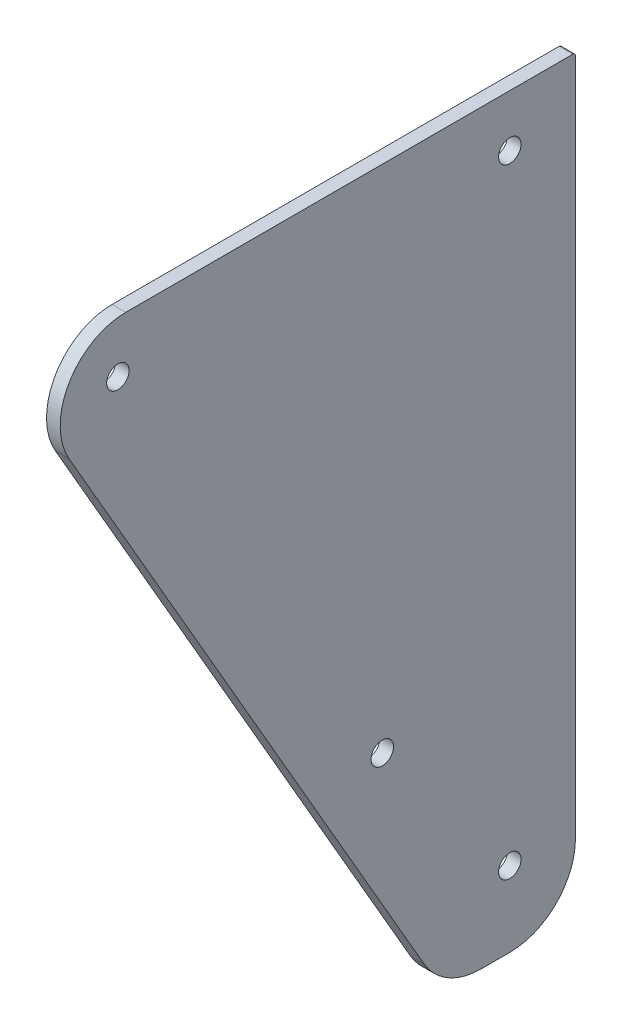
ISO-10303-21;
HEADER;
FILE_DESCRIPTION(('STEP AP214'),'2;1');
FILE_NAME('part.step','',(''),(''),'','','');
FILE_SCHEMA(('AUTOMOTIVE_DESIGN { 1 0 10303 214 1 1 1 1 }'));
ENDSEC;
DATA;
#1=APPLICATION_CONTEXT('core data for automotive mechanical design processes');
#2=APPLICATION_PROTOCOL_DEFINITION('international standard','automotive_design',2000,#1);
#3=PRODUCT_CONTEXT('',#1,'mechanical');
#4=PRODUCT('Part','Part','',(#3));
#5=PRODUCT_RELATED_PRODUCT_CATEGORY('part','',(#4));
#6=PRODUCT_DEFINITION_FORMATION('','',#4);
#7=PRODUCT_DEFINITION_CONTEXT('part definition',#1,'design');
#8=PRODUCT_DEFINITION('design','',#6,#7);
#9=PRODUCT_DEFINITION_SHAPE('','',#8);
#10=(LENGTH_UNIT() NAMED_UNIT(*) SI_UNIT(.MILLI.,.METRE.));
#11=(NAMED_UNIT(*) PLANE_ANGLE_UNIT() SI_UNIT($,.RADIAN.));
#12=(NAMED_UNIT(*) SI_UNIT($,.STERADIAN.) SOLID_ANGLE_UNIT());
#13=UNCERTAINTY_MEASURE_WITH_UNIT(LENGTH_MEASURE(1.E-05),#10,'distance_accuracy_value','');
#14=(GEOMETRIC_REPRESENTATION_CONTEXT(3) GLOBAL_UNCERTAINTY_ASSIGNED_CONTEXT((#13)) GLOBAL_UNIT_ASSIGNED_CONTEXT((#10,
#11,#12)) REPRESENTATION_CONTEXT('',''));
#15=CARTESIAN_POINT('',(0.,0.,0.));
#16=DIRECTION('',(0.,0.,1.));
#17=DIRECTION('',(1.,0.,0.));
#18=AXIS2_PLACEMENT_3D('',#15,#16,#17);
#19=CARTESIAN_POINT('',(5.,25.,10.5662432702593));
#20=DIRECTION('',(-1.,0.,0.));
#21=DIRECTION('',(0.,0.,1.));
#22=AXIS2_PLACEMENT_3D('',#19,#20,#21);
#23=CYLINDRICAL_SURFACE('',#22,24.);
#24=CARTESIAN_POINT('',(0.,25.,10.5662432702593));
#25=DIRECTION('',(-1.,0.,0.));
#26=DIRECTION('',(0.,0.,1.));
#27=AXIS2_PLACEMENT_3D('',#24,#25,#26);
#28=CIRCLE('',#27,24.);
#29=CARTESIAN_POINT('',(0.,1.,10.5662432702593));
#30=VERTEX_POINT('',#29);
#31=CARTESIAN_POINT('',(0.,13.0000000000001,31.3508529610859));
#32=VERTEX_POINT('',#31);
#33=EDGE_CURVE('E145',#30,#32,#28,.T.);
#34=ORIENTED_EDGE('',*,*,#33,.F.);
#35=DIRECTION('',(-1.,0.,0.));
#36=VECTOR('',#35,1.);
#37=CARTESIAN_POINT('',(5.,1.,10.5662432702593));
#38=LINE('',#37,#36);
#39=CARTESIAN_POINT('',(5.,1.,10.5662432702593));
#40=VERTEX_POINT('',#39);
#41=EDGE_CURVE('E11',#40,#30,#38,.T.);
#42=ORIENTED_EDGE('',*,*,#41,.F.);
#43=CARTESIAN_POINT('',(5.,25.,10.5662432702593));
#44=DIRECTION('',(-1.,0.,0.));
#45=DIRECTION('',(0.,0.,1.));
#46=AXIS2_PLACEMENT_3D('',#43,#44,#45);
#47=CIRCLE('',#46,24.);
#48=CARTESIAN_POINT('',(5.,13.0000000000001,31.3508529610859));
#49=VERTEX_POINT('',#48);
#50=EDGE_CURVE('E174',#40,#49,#47,.T.);
#51=ORIENTED_EDGE('',*,*,#50,.T.);
#52=DIRECTION('',(-1.,0.,0.));
#53=VECTOR('',#52,1.);
#54=CARTESIAN_POINT('',(5.,13.0000000000001,31.3508529610859));
#55=LINE('',#54,#53);
#56=EDGE_CURVE('E45',#49,#32,#55,.T.);
#57=ORIENTED_EDGE('',*,*,#56,.T.);
#58=EDGE_LOOP('',(#34,#42,#51,#57));
#59=FACE_BOUND('',#58,.T.);
#60=ADVANCED_FACE('F42',(#59),#23,.T.);
#61=CARTESIAN_POINT('',(5.,1.,0.));
#62=DIRECTION('',(0.,-1.,0.));
#63=DIRECTION('',(0.,0.,-1.));
#64=AXIS2_PLACEMENT_3D('',#61,#62,#63);
#65=PLANE('',#64);
#66=DIRECTION('',(0.,0.,1.));
#67=VECTOR('',#66,1.);
#68=CARTESIAN_POINT('',(0.,1.,0.));
#69=LINE('',#68,#67);
#70=CARTESIAN_POINT('',(0.,0.999999999999997,0.));
#71=VERTEX_POINT('',#70);
#72=EDGE_CURVE('E171',#71,#30,#69,.T.);
#73=ORIENTED_EDGE('',*,*,#72,.F.);
#74=DIRECTION('',(-1.,0.,0.));
#75=VECTOR('',#74,1.);
#76=CARTESIAN_POINT('',(5.,0.999999999999997,0.));
#77=LINE('',#76,#75);
#78=CARTESIAN_POINT('',(5.,0.999999999999997,0.));
#79=VERTEX_POINT('',#78);
#80=EDGE_CURVE('E52',#79,#71,#77,.T.);
#81=ORIENTED_EDGE('',*,*,#80,.F.);
#82=DIRECTION('',(0.,0.,1.));
#83=VECTOR('',#82,1.);
#84=CARTESIAN_POINT('',(5.,1.,0.));
#85=LINE('',#84,#83);
#86=EDGE_CURVE('E131',#79,#40,#85,.T.);
#87=ORIENTED_EDGE('',*,*,#86,.T.);
#88=ORIENTED_EDGE('',*,*,#41,.T.);
#89=EDGE_LOOP('',(#73,#81,#87,#88));
#90=FACE_BOUND('',#89,.T.);
#91=ADVANCED_FACE('F192',(#90),#65,.T.);
#92=CARTESIAN_POINT('',(5.,25.,0.));
#93=DIRECTION('',(-1.,0.,0.));
#94=DIRECTION('',(0.,0.,1.));
#95=AXIS2_PLACEMENT_3D('',#92,#93,#94);
#96=CYLINDRICAL_SURFACE('',#95,24.);
#97=CARTESIAN_POINT('',(0.,25.,0.));
#98=DIRECTION('',(-1.,0.,0.));
#99=DIRECTION('',(0.,0.,1.));
#100=AXIS2_PLACEMENT_3D('',#97,#98,#99);
#101=CIRCLE('',#100,24.);
#102=CARTESIAN_POINT('',(0.,25.,-24.));
#103=VERTEX_POINT('',#102);
#104=EDGE_CURVE('E117',#103,#71,#101,.T.);
#105=ORIENTED_EDGE('',*,*,#104,.F.);
#106=DIRECTION('',(-1.,0.,0.));
#107=VECTOR('',#106,1.);
#108=CARTESIAN_POINT('',(5.,25.,-24.));
#109=LINE('',#108,#107);
#110=CARTESIAN_POINT('',(5.,25.,-24.));
#111=VERTEX_POINT('',#110);
#112=EDGE_CURVE('E112',#111,#103,#109,.T.);
#113=ORIENTED_EDGE('',*,*,#112,.F.);
#114=CARTESIAN_POINT('',(5.,25.,0.));
#115=DIRECTION('',(-1.,0.,0.));
#116=DIRECTION('',(0.,0.,1.));
#117=AXIS2_PLACEMENT_3D('',#114,#115,#116);
#118=CIRCLE('',#117,24.);
#119=EDGE_CURVE('E115',#111,#79,#118,.T.);
#120=ORIENTED_EDGE('',*,*,#119,.T.);
#121=ORIENTED_EDGE('',*,*,#80,.T.);
#122=EDGE_LOOP('',(#105,#113,#120,#121));
#123=FACE_BOUND('',#122,.T.);
#124=ADVANCED_FACE('F114',(#123),#96,.T.);
#125=CARTESIAN_POINT('',(5.,273.,-24.));
#126=DIRECTION('',(0.,0.,-1.));
#127=DIRECTION('',(-1.,0.,0.));
#128=AXIS2_PLACEMENT_3D('',#125,#126,#127);
#129=PLANE('',#128);
#130=DIRECTION('',(0.,-1.,0.));
#131=VECTOR('',#130,1.);
#132=CARTESIAN_POINT('',(0.,273.,-24.));
#133=LINE('',#132,#131);
#134=CARTESIAN_POINT('',(0.,273.,-24.));
#135=VERTEX_POINT('',#134);
#136=EDGE_CURVE('E166',#135,#103,#133,.T.);
#137=ORIENTED_EDGE('',*,*,#136,.F.);
#138=DIRECTION('',(-1.,0.,0.));
#139=VECTOR('',#138,1.);
#140=CARTESIAN_POINT('',(5.,273.,-24.));
#141=LINE('',#140,#139);
#142=CARTESIAN_POINT('',(5.,273.,-24.));
#143=VERTEX_POINT('',#142);
#144=EDGE_CURVE('E123',#143,#135,#141,.T.);
#145=ORIENTED_EDGE('',*,*,#144,.F.);
#146=DIRECTION('',(0.,-1.,0.));
#147=VECTOR('',#146,1.);
#148=CARTESIAN_POINT('',(5.,273.,-24.));
#149=LINE('',#148,#147);
#150=EDGE_CURVE('E129',#143,#111,#149,.T.);
#151=ORIENTED_EDGE('',*,*,#150,.T.);
#152=ORIENTED_EDGE('',*,*,#112,.T.);
#153=EDGE_LOOP('',(#137,#145,#151,#152));
#154=FACE_BOUND('',#153,.T.);
#155=ADVANCED_FACE('F134',(#154),#129,.T.);
#156=CARTESIAN_POINT('',(5.,273.,-23.));
#157=DIRECTION('',(-1.,0.,0.));
#158=DIRECTION('',(0.,0.,1.));
#159=AXIS2_PLACEMENT_3D('',#156,#157,#158);
#160=CYLINDRICAL_SURFACE('',#159,1.);
#161=CARTESIAN_POINT('',(0.,273.,-23.));
#162=DIRECTION('',(-1.,0.,0.));
#163=DIRECTION('',(0.,0.,1.));
#164=AXIS2_PLACEMENT_3D('',#161,#162,#163);
#165=CIRCLE('',#164,1.);
#166=CARTESIAN_POINT('',(0.,274.,-23.));
#167=VERTEX_POINT('',#166);
#168=EDGE_CURVE('E162',#167,#135,#165,.T.);
#169=ORIENTED_EDGE('',*,*,#168,.F.);
#170=DIRECTION('',(-1.,0.,0.));
#171=VECTOR('',#170,1.);
#172=CARTESIAN_POINT('',(5.,274.,-23.));
#173=LINE('',#172,#171);
#174=CARTESIAN_POINT('',(5.,274.,-23.));
#175=VERTEX_POINT('',#174);
#176=EDGE_CURVE('E180',#175,#167,#173,.T.);
#177=ORIENTED_EDGE('',*,*,#176,.F.);
#178=CARTESIAN_POINT('',(5.,273.,-23.));
#179=DIRECTION('',(-1.,0.,0.));
#180=DIRECTION('',(0.,0.,1.));
#181=AXIS2_PLACEMENT_3D('',#178,#179,#180);
#182=CIRCLE('',#181,1.);
#183=EDGE_CURVE('E136',#175,#143,#182,.T.);
#184=ORIENTED_EDGE('',*,*,#183,.T.);
#185=ORIENTED_EDGE('',*,*,#144,.T.);
#186=EDGE_LOOP('',(#169,#177,#184,#185));
#187=FACE_BOUND('',#186,.T.);
#188=ADVANCED_FACE('F205',(#187),#160,.T.);
#189=CARTESIAN_POINT('',(5.,274.,140.470053837923));
#190=DIRECTION('',(0.,1.,0.));
#191=DIRECTION('',(0.,0.,1.));
#192=AXIS2_PLACEMENT_3D('',#189,#190,#191);
#193=PLANE('',#192);
#194=DIRECTION('',(0.,0.,-1.));
#195=VECTOR('',#194,1.);
#196=CARTESIAN_POINT('',(0.,274.,140.470053837923));
#197=LINE('',#196,#195);
#198=CARTESIAN_POINT('',(0.,274.,140.470053837923));
#199=VERTEX_POINT('',#198);
#200=EDGE_CURVE('E158',#199,#167,#197,.T.);
#201=ORIENTED_EDGE('',*,*,#200,.F.);
#202=DIRECTION('',(-1.,0.,0.));
#203=VECTOR('',#202,1.);
#204=CARTESIAN_POINT('',(5.,274.,140.470053837923));
#205=LINE('',#204,#203);
#206=CARTESIAN_POINT('',(5.,274.,140.470053837923));
#207=VERTEX_POINT('',#206);
#208=EDGE_CURVE('E183',#207,#199,#205,.T.);
#209=ORIENTED_EDGE('',*,*,#208,.F.);
#210=DIRECTION('',(0.,0.,-1.));
#211=VECTOR('',#210,1.);
#212=CARTESIAN_POINT('',(5.,274.,140.470053837923));
#213=LINE('',#212,#211);
#214=EDGE_CURVE('E139',#207,#175,#213,.T.);
#215=ORIENTED_EDGE('',*,*,#214,.T.);
#216=ORIENTED_EDGE('',*,*,#176,.T.);
#217=EDGE_LOOP('',(#201,#209,#215,#216));
#218=FACE_BOUND('',#217,.T.);
#219=ADVANCED_FACE('F208',(#218),#193,.T.);
#220=CARTESIAN_POINT('',(5.,250.,140.470053837923));
#221=DIRECTION('',(-1.,0.,0.));
#222=DIRECTION('',(0.,0.,1.));
#223=AXIS2_PLACEMENT_3D('',#220,#221,#222);
#224=CYLINDRICAL_SURFACE('',#223,24.);
#225=CARTESIAN_POINT('',(0.,250.,140.470053837923));
#226=DIRECTION('',(-1.,0.,0.));
#227=DIRECTION('',(0.,0.,1.));
#228=AXIS2_PLACEMENT_3D('',#225,#226,#227);
#229=CIRCLE('',#228,24.);
#230=CARTESIAN_POINT('',(0.,238.,161.25466352875));
#231=VERTEX_POINT('',#230);
#232=EDGE_CURVE('E154',#231,#199,#229,.T.);
#233=ORIENTED_EDGE('',*,*,#232,.F.);
#234=DIRECTION('',(-1.,0.,0.));
#235=VECTOR('',#234,1.);
#236=CARTESIAN_POINT('',(5.,238.,161.25466352875));
#237=LINE('',#236,#235);
#238=CARTESIAN_POINT('',(5.,238.,161.25466352875));
#239=VERTEX_POINT('',#238);
#240=EDGE_CURVE('E185',#239,#231,#237,.T.);
#241=ORIENTED_EDGE('',*,*,#240,.F.);
#242=CARTESIAN_POINT('',(5.,250.,140.470053837923));
#243=DIRECTION('',(-1.,0.,0.));
#244=DIRECTION('',(0.,0.,1.));
#245=AXIS2_PLACEMENT_3D('',#242,#243,#244);
#246=CIRCLE('',#245,24.);
#247=EDGE_CURVE('E284',#239,#207,#246,.T.);
#248=ORIENTED_EDGE('',*,*,#247,.T.);
#249=ORIENTED_EDGE('',*,*,#208,.T.);
#250=EDGE_LOOP('',(#233,#241,#248,#249));
#251=FACE_BOUND('',#250,.T.);
#252=ADVANCED_FACE('F212',(#251),#224,.T.);
#253=CARTESIAN_POINT('',(5.,13.0000000000001,31.3508529610859));
#254=DIRECTION('',(0.,-0.499999999999995,0.866025403784442));
#255=DIRECTION('',(0.,-0.866025403784442,-0.499999999999995));
#256=AXIS2_PLACEMENT_3D('',#253,#254,#255);
#257=PLANE('',#256);
#258=DIRECTION('',(0.,0.866025403784442,0.499999999999995));
#259=VECTOR('',#258,1.);
#260=CARTESIAN_POINT('',(0.,13.0000000000001,31.3508529610859));
#261=LINE('',#260,#259);
#262=EDGE_CURVE('E149',#32,#231,#261,.T.);
#263=ORIENTED_EDGE('',*,*,#262,.F.);
#264=ORIENTED_EDGE('',*,*,#56,.F.);
#265=DIRECTION('',(0.,0.866025403784442,0.499999999999995));
#266=VECTOR('',#265,1.);
#267=CARTESIAN_POINT('',(5.,13.0000000000001,31.3508529610859));
#268=LINE('',#267,#266);
#269=EDGE_CURVE('E281',#49,#239,#268,.T.);
#270=ORIENTED_EDGE('',*,*,#269,.T.);
#271=ORIENTED_EDGE('',*,*,#240,.T.);
#272=EDGE_LOOP('',(#263,#264,#270,#271));
#273=FACE_BOUND('',#272,.T.);
#274=ADVANCED_FACE('F189',(#273),#257,.T.);
#275=CARTESIAN_POINT('',(5.,25.,10.5662432702593));
#276=DIRECTION('',(-1.,0.,0.));
#277=DIRECTION('',(0.,0.,1.));
#278=AXIS2_PLACEMENT_3D('',#275,#276,#277);
#279=PLANE('',#278);
#280=CARTESIAN_POINT('',(5.,87.5000000000012,46.650635094611));
#281=DIRECTION('',(-1.,0.,0.));
#282=DIRECTION('',(0.,0.,-1.));
#283=AXIS2_PLACEMENT_3D('',#280,#281,#282);
#284=CIRCLE('',#283,4.1);
#285=CARTESIAN_POINT('',(5.,87.5000000000012,42.550635094611));
#286=VERTEX_POINT('',#285);
#287=EDGE_CURVE('E247',#286,#286,#284,.T.);
#288=ORIENTED_EDGE('',*,*,#287,.T.);
#289=EDGE_LOOP('',(#288));
#290=FACE_BOUND('',#289,.T.);
#291=CARTESIAN_POINT('',(5.,28.5,0.));
#292=DIRECTION('',(-1.,0.,0.));
#293=DIRECTION('',(0.,0.,-1.));
#294=AXIS2_PLACEMENT_3D('',#291,#292,#293);
#295=CIRCLE('',#294,4.1);
#296=CARTESIAN_POINT('',(5.,28.5,-4.1));
#297=VERTEX_POINT('',#296);
#298=EDGE_CURVE('E257',#297,#297,#295,.T.);
#299=ORIENTED_EDGE('',*,*,#298,.T.);
#300=EDGE_LOOP('',(#299));
#301=FACE_BOUND('',#300,.T.);
#302=CARTESIAN_POINT('',(5.,255.,0.));
#303=DIRECTION('',(-1.,0.,0.));
#304=DIRECTION('',(0.,0.,-1.));
#305=AXIS2_PLACEMENT_3D('',#302,#303,#304);
#306=CIRCLE('',#305,4.1);
#307=CARTESIAN_POINT('',(5.,255.,-4.1));
#308=VERTEX_POINT('',#307);
#309=EDGE_CURVE('E265',#308,#308,#306,.T.);
#310=ORIENTED_EDGE('',*,*,#309,.T.);
#311=EDGE_LOOP('',(#310));
#312=FACE_BOUND('',#311,.T.);
#313=CARTESIAN_POINT('',(5.,255.,143.356805183871));
#314=DIRECTION('',(-1.,0.,0.));
#315=DIRECTION('',(0.,0.,-1.));
#316=AXIS2_PLACEMENT_3D('',#313,#314,#315);
#317=CIRCLE('',#316,4.09999999999997);
#318=CARTESIAN_POINT('',(5.,255.,139.256805183871));
#319=VERTEX_POINT('',#318);
#320=EDGE_CURVE('E150',#319,#319,#317,.T.);
#321=ORIENTED_EDGE('',*,*,#320,.T.);
#322=EDGE_LOOP('',(#321));
#323=FACE_BOUND('',#322,.T.);
#324=ORIENTED_EDGE('',*,*,#50,.F.);
#325=ORIENTED_EDGE('',*,*,#86,.F.);
#326=ORIENTED_EDGE('',*,*,#119,.F.);
#327=ORIENTED_EDGE('',*,*,#150,.F.);
#328=ORIENTED_EDGE('',*,*,#183,.F.);
#329=ORIENTED_EDGE('',*,*,#214,.F.);
#330=ORIENTED_EDGE('',*,*,#247,.F.);
#331=ORIENTED_EDGE('',*,*,#269,.F.);
#332=EDGE_LOOP('',(#324,#325,#326,#327,#328,#329,#330,#331));
#333=FACE_BOUND('',#332,.T.);
#334=ADVANCED_FACE('F127',(#290,#301,#312,#323,#333),#279,.F.);
#335=CARTESIAN_POINT('',(0.,25.,10.5662432702593));
#336=DIRECTION('',(-1.,0.,0.));
#337=DIRECTION('',(0.,0.,1.));
#338=AXIS2_PLACEMENT_3D('',#335,#336,#337);
#339=PLANE('',#338);
#340=CARTESIAN_POINT('',(0.,87.5000000000012,46.650635094611));
#341=DIRECTION('',(-1.,0.,0.));
#342=DIRECTION('',(0.,0.,-1.));
#343=AXIS2_PLACEMENT_3D('',#340,#341,#342);
#344=CIRCLE('',#343,4.1);
#345=CARTESIAN_POINT('',(0.,87.5000000000012,42.550635094611));
#346=VERTEX_POINT('',#345);
#347=EDGE_CURVE('E250',#346,#346,#344,.T.);
#348=ORIENTED_EDGE('',*,*,#347,.F.);
#349=EDGE_LOOP('',(#348));
#350=FACE_BOUND('',#349,.T.);
#351=CARTESIAN_POINT('',(0.,28.5,0.));
#352=DIRECTION('',(-1.,0.,0.));
#353=DIRECTION('',(0.,0.,-1.));
#354=AXIS2_PLACEMENT_3D('',#351,#352,#353);
#355=CIRCLE('',#354,4.1);
#356=CARTESIAN_POINT('',(0.,28.5,-4.1));
#357=VERTEX_POINT('',#356);
#358=EDGE_CURVE('E254',#357,#357,#355,.T.);
#359=ORIENTED_EDGE('',*,*,#358,.F.);
#360=EDGE_LOOP('',(#359));
#361=FACE_BOUND('',#360,.T.);
#362=CARTESIAN_POINT('',(0.,255.,0.));
#363=DIRECTION('',(-1.,0.,0.));
#364=DIRECTION('',(0.,0.,-1.));
#365=AXIS2_PLACEMENT_3D('',#362,#363,#364);
#366=CIRCLE('',#365,4.1);
#367=CARTESIAN_POINT('',(0.,255.,-4.1));
#368=VERTEX_POINT('',#367);
#369=EDGE_CURVE('E261',#368,#368,#366,.T.);
#370=ORIENTED_EDGE('',*,*,#369,.F.);
#371=EDGE_LOOP('',(#370));
#372=FACE_BOUND('',#371,.T.);
#373=CARTESIAN_POINT('',(0.,255.,143.356805183871));
#374=DIRECTION('',(-1.,0.,0.));
#375=DIRECTION('',(0.,0.,-1.));
#376=AXIS2_PLACEMENT_3D('',#373,#374,#375);
#377=CIRCLE('',#376,4.09999999999997);
#378=CARTESIAN_POINT('',(0.,255.,139.256805183871));
#379=VERTEX_POINT('',#378);
#380=EDGE_CURVE('E269',#379,#379,#377,.T.);
#381=ORIENTED_EDGE('',*,*,#380,.F.);
#382=EDGE_LOOP('',(#381));
#383=FACE_BOUND('',#382,.T.);
#384=ORIENTED_EDGE('',*,*,#33,.T.);
#385=ORIENTED_EDGE('',*,*,#262,.T.);
#386=ORIENTED_EDGE('',*,*,#232,.T.);
#387=ORIENTED_EDGE('',*,*,#200,.T.);
#388=ORIENTED_EDGE('',*,*,#168,.T.);
#389=ORIENTED_EDGE('',*,*,#136,.T.);
#390=ORIENTED_EDGE('',*,*,#104,.T.);
#391=ORIENTED_EDGE('',*,*,#72,.T.);
#392=EDGE_LOOP('',(#384,#385,#386,#387,#388,#389,#390,#391));
#393=FACE_BOUND('',#392,.T.);
#394=ADVANCED_FACE('F191',(#350,#361,#372,#383,#393),#339,.T.);
#395=CARTESIAN_POINT('',(5.,255.,143.356805183871));
#396=DIRECTION('',(-1.,0.,0.));
#397=DIRECTION('',(0.,0.,1.));
#398=AXIS2_PLACEMENT_3D('',#395,#396,#397);
#399=CYLINDRICAL_SURFACE('',#398,4.09999999999997);
#400=ORIENTED_EDGE('',*,*,#320,.F.);
#401=EDGE_LOOP('',(#400));
#402=FACE_BOUND('',#401,.T.);
#403=ORIENTED_EDGE('',*,*,#380,.T.);
#404=EDGE_LOOP('',(#403));
#405=FACE_BOUND('',#404,.T.);
#406=ADVANCED_FACE('F224',(#402,#405),#399,.F.);
#407=CARTESIAN_POINT('',(5.,255.,0.));
#408=DIRECTION('',(-1.,0.,0.));
#409=DIRECTION('',(0.,0.,1.));
#410=AXIS2_PLACEMENT_3D('',#407,#408,#409);
#411=CYLINDRICAL_SURFACE('',#410,4.1);
#412=ORIENTED_EDGE('',*,*,#309,.F.);
#413=EDGE_LOOP('',(#412));
#414=FACE_BOUND('',#413,.T.);
#415=ORIENTED_EDGE('',*,*,#369,.T.);
#416=EDGE_LOOP('',(#415));
#417=FACE_BOUND('',#416,.T.);
#418=ADVANCED_FACE('F231',(#414,#417),#411,.F.);
#419=CARTESIAN_POINT('',(5.,28.5,0.));
#420=DIRECTION('',(-1.,0.,0.));
#421=DIRECTION('',(0.,0.,1.));
#422=AXIS2_PLACEMENT_3D('',#419,#420,#421);
#423=CYLINDRICAL_SURFACE('',#422,4.1);
#424=ORIENTED_EDGE('',*,*,#298,.F.);
#425=EDGE_LOOP('',(#424));
#426=FACE_BOUND('',#425,.T.);
#427=ORIENTED_EDGE('',*,*,#358,.T.);
#428=EDGE_LOOP('',(#427));
#429=FACE_BOUND('',#428,.T.);
#430=ADVANCED_FACE('F235',(#426,#429),#423,.F.);
#431=CARTESIAN_POINT('',(5.,87.5000000000012,46.650635094611));
#432=DIRECTION('',(-1.,0.,0.));
#433=DIRECTION('',(0.,0.,1.));
#434=AXIS2_PLACEMENT_3D('',#431,#432,#433);
#435=CYLINDRICAL_SURFACE('',#434,4.1);
#436=ORIENTED_EDGE('',*,*,#287,.F.);
#437=EDGE_LOOP('',(#436));
#438=FACE_BOUND('',#437,.T.);
#439=ORIENTED_EDGE('',*,*,#347,.T.);
#440=EDGE_LOOP('',(#439));
#441=FACE_BOUND('',#440,.T.);
#442=ADVANCED_FACE('F239',(#438,#441),#435,.F.);
#443=CLOSED_SHELL('',(#60,#91,#124,#155,#188,#219,#252,#274,#334,#394,#406,#418,#430,#442));
#444=MANIFOLD_SOLID_BREP('B2',#443);
#445=ADVANCED_BREP_SHAPE_REPRESENTATION('',(#18,#444),#14);
#446=SHAPE_DEFINITION_REPRESENTATION(#9,#445);
ENDSEC;
END-ISO-10303-21;
